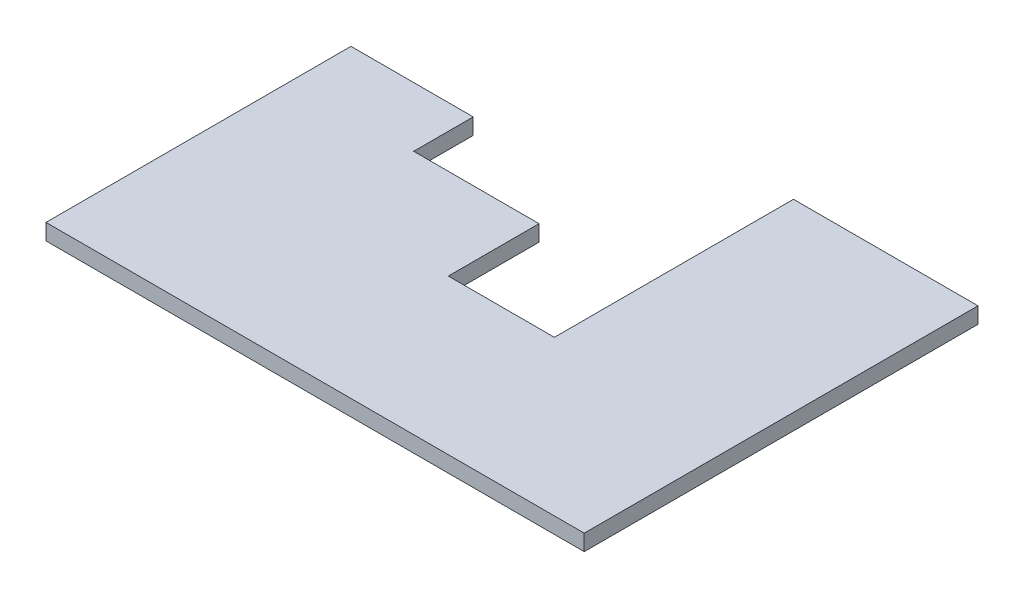
ISO-10303-21;
HEADER;
FILE_DESCRIPTION(('STEP AP214'),'2;1');
FILE_NAME('part.step','',(''),(''),'','','');
FILE_SCHEMA(('AUTOMOTIVE_DESIGN { 1 0 10303 214 1 1 1 1 }'));
ENDSEC;
DATA;
#1=APPLICATION_CONTEXT('core data for automotive mechanical design processes');
#2=APPLICATION_PROTOCOL_DEFINITION('international standard','automotive_design',2000,#1);
#3=PRODUCT_CONTEXT('',#1,'mechanical');
#4=PRODUCT('Part','Part','',(#3));
#5=PRODUCT_RELATED_PRODUCT_CATEGORY('part','',(#4));
#6=PRODUCT_DEFINITION_FORMATION('','',#4);
#7=PRODUCT_DEFINITION_CONTEXT('part definition',#1,'design');
#8=PRODUCT_DEFINITION('design','',#6,#7);
#9=PRODUCT_DEFINITION_SHAPE('','',#8);
#10=(LENGTH_UNIT() NAMED_UNIT(*) SI_UNIT(.MILLI.,.METRE.));
#11=(NAMED_UNIT(*) PLANE_ANGLE_UNIT() SI_UNIT($,.RADIAN.));
#12=(NAMED_UNIT(*) SI_UNIT($,.STERADIAN.) SOLID_ANGLE_UNIT());
#13=UNCERTAINTY_MEASURE_WITH_UNIT(LENGTH_MEASURE(1.E-05),#10,'distance_accuracy_value','');
#14=(GEOMETRIC_REPRESENTATION_CONTEXT(3) GLOBAL_UNCERTAINTY_ASSIGNED_CONTEXT((#13)) GLOBAL_UNIT_ASSIGNED_CONTEXT((#10,
#11,#12)) REPRESENTATION_CONTEXT('',''));
#15=CARTESIAN_POINT('',(0.,0.,0.));
#16=DIRECTION('',(0.,0.,1.));
#17=DIRECTION('',(1.,0.,0.));
#18=AXIS2_PLACEMENT_3D('',#15,#16,#17);
#19=CARTESIAN_POINT('',(97.207622704,2.9,0.));
#20=DIRECTION('',(0.,0.,-1.));
#21=DIRECTION('',(-1.,0.,0.));
#22=AXIS2_PLACEMENT_3D('',#19,#20,#21);
#23=PLANE('',#22);
#24=DIRECTION('',(1.,0.,0.));
#25=VECTOR('',#24,1.);
#26=CARTESIAN_POINT('',(97.207622704,0.,0.));
#27=LINE('',#26,#25);
#28=CARTESIAN_POINT('',(0.,0.,0.));
#29=VERTEX_POINT('',#28);
#30=CARTESIAN_POINT('',(97.207622704,0.,0.));
#31=VERTEX_POINT('',#30);
#32=EDGE_CURVE('E154',#29,#31,#27,.T.);
#33=ORIENTED_EDGE('',*,*,#32,.T.);
#34=DIRECTION('',(0.,-1.,0.));
#35=VECTOR('',#34,1.);
#36=CARTESIAN_POINT('',(97.207622704,2.9,0.));
#37=LINE('',#36,#35);
#38=CARTESIAN_POINT('',(97.207622704,2.9,0.));
#39=VERTEX_POINT('',#38);
#40=EDGE_CURVE('E195',#39,#31,#37,.T.);
#41=ORIENTED_EDGE('',*,*,#40,.F.);
#42=DIRECTION('',(1.,0.,0.));
#43=VECTOR('',#42,1.);
#44=CARTESIAN_POINT('',(97.207622704,2.9,0.));
#45=LINE('',#44,#43);
#46=CARTESIAN_POINT('',(0.,2.9,0.));
#47=VERTEX_POINT('',#46);
#48=EDGE_CURVE('E176',#47,#39,#45,.T.);
#49=ORIENTED_EDGE('',*,*,#48,.F.);
#50=DIRECTION('',(0.,-1.,0.));
#51=VECTOR('',#50,1.);
#52=CARTESIAN_POINT('',(0.,2.9,0.));
#53=LINE('',#52,#51);
#54=EDGE_CURVE('E150',#47,#29,#53,.T.);
#55=ORIENTED_EDGE('',*,*,#54,.T.);
#56=EDGE_LOOP('',(#33,#41,#49,#55));
#57=FACE_BOUND('',#56,.T.);
#58=ADVANCED_FACE('F33',(#57),#23,.F.);
#59=CARTESIAN_POINT('',(97.207622704,2.9,-71.117097796));
#60=DIRECTION('',(-1.,0.,0.));
#61=DIRECTION('',(0.,0.,1.));
#62=AXIS2_PLACEMENT_3D('',#59,#60,#61);
#63=PLANE('',#62);
#64=DIRECTION('',(0.,0.,-1.));
#65=VECTOR('',#64,1.);
#66=CARTESIAN_POINT('',(97.207622704,0.,-71.117097796));
#67=LINE('',#66,#65);
#68=CARTESIAN_POINT('',(97.207622704,0.,-71.117097796));
#69=VERTEX_POINT('',#68);
#70=EDGE_CURVE('E157',#31,#69,#67,.T.);
#71=ORIENTED_EDGE('',*,*,#70,.T.);
#72=DIRECTION('',(0.,-1.,0.));
#73=VECTOR('',#72,1.);
#74=CARTESIAN_POINT('',(97.207622704,2.9,-71.117097796));
#75=LINE('',#74,#73);
#76=CARTESIAN_POINT('',(97.207622704,2.9,-71.117097796));
#77=VERTEX_POINT('',#76);
#78=EDGE_CURVE('E192',#77,#69,#75,.T.);
#79=ORIENTED_EDGE('',*,*,#78,.F.);
#80=DIRECTION('',(0.,0.,-1.));
#81=VECTOR('',#80,1.);
#82=CARTESIAN_POINT('',(97.207622704,2.9,-71.117097796));
#83=LINE('',#82,#81);
#84=EDGE_CURVE('E104',#39,#77,#83,.T.);
#85=ORIENTED_EDGE('',*,*,#84,.F.);
#86=ORIENTED_EDGE('',*,*,#40,.T.);
#87=EDGE_LOOP('',(#71,#79,#85,#86));
#88=FACE_BOUND('',#87,.T.);
#89=ADVANCED_FACE('F255',(#88),#63,.F.);
#90=CARTESIAN_POINT('',(63.88136576,2.9,-71.117097796));
#91=DIRECTION('',(0.,0.,1.));
#92=DIRECTION('',(1.,0.,0.));
#93=AXIS2_PLACEMENT_3D('',#90,#91,#92);
#94=PLANE('',#93);
#95=DIRECTION('',(-1.,0.,0.));
#96=VECTOR('',#95,1.);
#97=CARTESIAN_POINT('',(63.88136576,0.,-71.117097796));
#98=LINE('',#97,#96);
#99=CARTESIAN_POINT('',(63.88136576,0.,-71.117097796));
#100=VERTEX_POINT('',#99);
#101=EDGE_CURVE('E160',#69,#100,#98,.T.);
#102=ORIENTED_EDGE('',*,*,#101,.T.);
#103=DIRECTION('',(0.,-1.,0.));
#104=VECTOR('',#103,1.);
#105=CARTESIAN_POINT('',(63.88136576,2.9,-71.117097796));
#106=LINE('',#105,#104);
#107=CARTESIAN_POINT('',(63.88136576,2.9,-71.117097796));
#108=VERTEX_POINT('',#107);
#109=EDGE_CURVE('E189',#108,#100,#106,.T.);
#110=ORIENTED_EDGE('',*,*,#109,.F.);
#111=DIRECTION('',(-1.,0.,0.));
#112=VECTOR('',#111,1.);
#113=CARTESIAN_POINT('',(63.88136576,2.9,-71.117097796));
#114=LINE('',#113,#112);
#115=EDGE_CURVE('E228',#77,#108,#114,.T.);
#116=ORIENTED_EDGE('',*,*,#115,.F.);
#117=ORIENTED_EDGE('',*,*,#78,.T.);
#118=EDGE_LOOP('',(#102,#110,#116,#117));
#119=FACE_BOUND('',#118,.T.);
#120=ADVANCED_FACE('F258',(#119),#94,.F.);
#121=CARTESIAN_POINT('',(63.88136576,2.9,-27.937097796));
#122=DIRECTION('',(1.,0.,0.));
#123=DIRECTION('',(0.,0.,-1.));
#124=AXIS2_PLACEMENT_3D('',#121,#122,#123);
#125=PLANE('',#124);
#126=DIRECTION('',(0.,0.,1.));
#127=VECTOR('',#126,1.);
#128=CARTESIAN_POINT('',(63.88136576,0.,-27.937097796));
#129=LINE('',#128,#127);
#130=CARTESIAN_POINT('',(63.88136576,0.,-27.937097796));
#131=VERTEX_POINT('',#130);
#132=EDGE_CURVE('E162',#100,#131,#129,.T.);
#133=ORIENTED_EDGE('',*,*,#132,.T.);
#134=DIRECTION('',(0.,-1.,0.));
#135=VECTOR('',#134,1.);
#136=CARTESIAN_POINT('',(63.88136576,2.9,-27.937097796));
#137=LINE('',#136,#135);
#138=CARTESIAN_POINT('',(63.88136576,2.9,-27.937097796));
#139=VERTEX_POINT('',#138);
#140=EDGE_CURVE('E186',#139,#131,#137,.T.);
#141=ORIENTED_EDGE('',*,*,#140,.F.);
#142=DIRECTION('',(0.,0.,1.));
#143=VECTOR('',#142,1.);
#144=CARTESIAN_POINT('',(63.88136576,2.9,-27.937097796));
#145=LINE('',#144,#143);
#146=EDGE_CURVE('E230',#108,#139,#145,.T.);
#147=ORIENTED_EDGE('',*,*,#146,.F.);
#148=ORIENTED_EDGE('',*,*,#109,.T.);
#149=EDGE_LOOP('',(#133,#141,#147,#148));
#150=FACE_BOUND('',#149,.T.);
#151=ADVANCED_FACE('F263',(#150),#125,.F.);
#152=CARTESIAN_POINT('',(44.723008852,2.9,-27.937097796));
#153=DIRECTION('',(0.,0.,1.));
#154=DIRECTION('',(1.,0.,0.));
#155=AXIS2_PLACEMENT_3D('',#152,#153,#154);
#156=PLANE('',#155);
#157=DIRECTION('',(1.,0.,0.));
#158=VECTOR('',#157,1.);
#159=CARTESIAN_POINT('',(46.682187306,1.45,-27.937097796));
#160=LINE('',#159,#158);
#161=CARTESIAN_POINT('',(46.682187306,1.45,-27.937097796));
#162=VERTEX_POINT('',#161);
#163=CARTESIAN_POINT('',(61.922187306,1.45,-27.937097796));
#164=VERTEX_POINT('',#163);
#165=EDGE_CURVE('E212',#162,#164,#160,.T.);
#166=ORIENTED_EDGE('',*,*,#165,.F.);
#167=DIRECTION('',(0.,1.,0.));
#168=VECTOR('',#167,1.);
#169=CARTESIAN_POINT('',(46.682187306,0.,-27.937097796));
#170=LINE('',#169,#168);
#171=CARTESIAN_POINT('',(46.682187306,0.,-27.937097796));
#172=VERTEX_POINT('',#171);
#173=EDGE_CURVE('E217',#172,#162,#170,.T.);
#174=ORIENTED_EDGE('',*,*,#173,.F.);
#175=DIRECTION('',(-1.,0.,0.));
#176=VECTOR('',#175,1.);
#177=CARTESIAN_POINT('',(44.723008852,0.,-27.937097796));
#178=LINE('',#177,#176);
#179=CARTESIAN_POINT('',(44.723008852,0.,-27.937097796));
#180=VERTEX_POINT('',#179);
#181=EDGE_CURVE('E164',#172,#180,#178,.T.);
#182=ORIENTED_EDGE('',*,*,#181,.T.);
#183=DIRECTION('',(0.,-1.,0.));
#184=VECTOR('',#183,1.);
#185=CARTESIAN_POINT('',(44.723008852,2.9,-27.937097796));
#186=LINE('',#185,#184);
#187=CARTESIAN_POINT('',(44.723008852,2.9,-27.937097796));
#188=VERTEX_POINT('',#187);
#189=EDGE_CURVE('E183',#188,#180,#186,.T.);
#190=ORIENTED_EDGE('',*,*,#189,.F.);
#191=DIRECTION('',(-1.,0.,0.));
#192=VECTOR('',#191,1.);
#193=CARTESIAN_POINT('',(44.723008852,2.9,-27.937097796));
#194=LINE('',#193,#192);
#195=EDGE_CURVE('E232',#139,#188,#194,.T.);
#196=ORIENTED_EDGE('',*,*,#195,.F.);
#197=ORIENTED_EDGE('',*,*,#140,.T.);
#198=CARTESIAN_POINT('',(61.922187306,0.,-27.937097796));
#199=VERTEX_POINT('',#198);
#200=EDGE_CURVE('E165',#131,#199,#178,.T.);
#201=ORIENTED_EDGE('',*,*,#200,.T.);
#202=DIRECTION('',(0.,-1.,0.));
#203=VECTOR('',#202,1.);
#204=CARTESIAN_POINT('',(61.922187306,0.,-27.937097796));
#205=LINE('',#204,#203);
#206=EDGE_CURVE('E202',#164,#199,#205,.T.);
#207=ORIENTED_EDGE('',*,*,#206,.F.);
#208=EDGE_LOOP('',(#166,#174,#182,#190,#196,#197,#201,#207));
#209=FACE_BOUND('',#208,.T.);
#210=ADVANCED_FACE('F210',(#209),#156,.F.);
#211=CARTESIAN_POINT('',(44.723008852,2.9,-44.32387376));
#212=DIRECTION('',(-1.,0.,0.));
#213=DIRECTION('',(0.,0.,1.));
#214=AXIS2_PLACEMENT_3D('',#211,#212,#213);
#215=PLANE('',#214);
#216=DIRECTION('',(0.,0.,-1.));
#217=VECTOR('',#216,1.);
#218=CARTESIAN_POINT('',(44.723008852,0.,-44.32387376));
#219=LINE('',#218,#217);
#220=CARTESIAN_POINT('',(44.723008852,0.,-44.32387376));
#221=VERTEX_POINT('',#220);
#222=EDGE_CURVE('E168',#180,#221,#219,.T.);
#223=ORIENTED_EDGE('',*,*,#222,.T.);
#224=DIRECTION('',(0.,-1.,0.));
#225=VECTOR('',#224,1.);
#226=CARTESIAN_POINT('',(44.723008852,2.9,-44.32387376));
#227=LINE('',#226,#225);
#228=CARTESIAN_POINT('',(44.723008852,2.9,-44.32387376));
#229=VERTEX_POINT('',#228);
#230=EDGE_CURVE('E180',#229,#221,#227,.T.);
#231=ORIENTED_EDGE('',*,*,#230,.F.);
#232=DIRECTION('',(0.,0.,-1.));
#233=VECTOR('',#232,1.);
#234=CARTESIAN_POINT('',(44.723008852,2.9,-44.32387376));
#235=LINE('',#234,#233);
#236=EDGE_CURVE('E234',#188,#229,#235,.T.);
#237=ORIENTED_EDGE('',*,*,#236,.F.);
#238=ORIENTED_EDGE('',*,*,#189,.T.);
#239=EDGE_LOOP('',(#223,#231,#237,#238));
#240=FACE_BOUND('',#239,.T.);
#241=ADVANCED_FACE('F240',(#240),#215,.F.);
#242=CARTESIAN_POINT('',(22.080000036,2.9,-44.32387376));
#243=DIRECTION('',(0.,0.,1.));
#244=DIRECTION('',(1.,0.,0.));
#245=AXIS2_PLACEMENT_3D('',#242,#243,#244);
#246=PLANE('',#245);
#247=DIRECTION('',(-1.,0.,0.));
#248=VECTOR('',#247,1.);
#249=CARTESIAN_POINT('',(22.080000036,0.,-44.32387376));
#250=LINE('',#249,#248);
#251=CARTESIAN_POINT('',(22.080000036,0.,-44.32387376));
#252=VERTEX_POINT('',#251);
#253=EDGE_CURVE('E170',#221,#252,#250,.T.);
#254=ORIENTED_EDGE('',*,*,#253,.T.);
#255=DIRECTION('',(0.,-1.,0.));
#256=VECTOR('',#255,1.);
#257=CARTESIAN_POINT('',(22.080000036,2.9,-44.32387376));
#258=LINE('',#257,#256);
#259=CARTESIAN_POINT('',(22.080000036,2.9,-44.32387376));
#260=VERTEX_POINT('',#259);
#261=EDGE_CURVE('E145',#260,#252,#258,.T.);
#262=ORIENTED_EDGE('',*,*,#261,.F.);
#263=DIRECTION('',(-1.,0.,0.));
#264=VECTOR('',#263,1.);
#265=CARTESIAN_POINT('',(22.080000036,2.9,-44.32387376));
#266=LINE('',#265,#264);
#267=EDGE_CURVE('E133',#229,#260,#266,.T.);
#268=ORIENTED_EDGE('',*,*,#267,.F.);
#269=ORIENTED_EDGE('',*,*,#230,.T.);
#270=EDGE_LOOP('',(#254,#262,#268,#269));
#271=FACE_BOUND('',#270,.T.);
#272=ADVANCED_FACE('F244',(#271),#246,.F.);
#273=CARTESIAN_POINT('',(22.080000036,2.9,-55.080000076));
#274=DIRECTION('',(-1.,0.,0.));
#275=DIRECTION('',(0.,0.,1.));
#276=AXIS2_PLACEMENT_3D('',#273,#274,#275);
#277=PLANE('',#276);
#278=DIRECTION('',(0.,0.,-1.));
#279=VECTOR('',#278,1.);
#280=CARTESIAN_POINT('',(22.080000036,0.,-55.080000076));
#281=LINE('',#280,#279);
#282=CARTESIAN_POINT('',(22.080000036,0.,-55.080000076));
#283=VERTEX_POINT('',#282);
#284=EDGE_CURVE('E142',#252,#283,#281,.T.);
#285=ORIENTED_EDGE('',*,*,#284,.T.);
#286=DIRECTION('',(0.,-1.,0.));
#287=VECTOR('',#286,1.);
#288=CARTESIAN_POINT('',(22.080000036,2.9,-55.080000076));
#289=LINE('',#288,#287);
#290=CARTESIAN_POINT('',(22.080000036,2.9,-55.080000076));
#291=VERTEX_POINT('',#290);
#292=EDGE_CURVE('E139',#291,#283,#289,.T.);
#293=ORIENTED_EDGE('',*,*,#292,.F.);
#294=DIRECTION('',(0.,0.,-1.));
#295=VECTOR('',#294,1.);
#296=CARTESIAN_POINT('',(22.080000036,2.9,-55.080000076));
#297=LINE('',#296,#295);
#298=EDGE_CURVE('E126',#260,#291,#297,.T.);
#299=ORIENTED_EDGE('',*,*,#298,.F.);
#300=ORIENTED_EDGE('',*,*,#261,.T.);
#301=EDGE_LOOP('',(#285,#293,#299,#300));
#302=FACE_BOUND('',#301,.T.);
#303=ADVANCED_FACE('F140',(#302),#277,.F.);
#304=CARTESIAN_POINT('',(0.,2.9,-55.080000076));
#305=DIRECTION('',(0.,0.,1.));
#306=DIRECTION('',(1.,0.,0.));
#307=AXIS2_PLACEMENT_3D('',#304,#305,#306);
#308=PLANE('',#307);
#309=DIRECTION('',(-1.,0.,0.));
#310=VECTOR('',#309,1.);
#311=CARTESIAN_POINT('',(0.,0.,-55.080000076));
#312=LINE('',#311,#310);
#313=CARTESIAN_POINT('',(0.,0.,-55.080000076));
#314=VERTEX_POINT('',#313);
#315=EDGE_CURVE('E173',#283,#314,#312,.T.);
#316=ORIENTED_EDGE('',*,*,#315,.T.);
#317=DIRECTION('',(0.,-1.,0.));
#318=VECTOR('',#317,1.);
#319=CARTESIAN_POINT('',(0.,2.9,-55.080000076));
#320=LINE('',#319,#318);
#321=CARTESIAN_POINT('',(0.,2.9,-55.080000076));
#322=VERTEX_POINT('',#321);
#323=EDGE_CURVE('E146',#322,#314,#320,.T.);
#324=ORIENTED_EDGE('',*,*,#323,.F.);
#325=DIRECTION('',(-1.,0.,0.));
#326=VECTOR('',#325,1.);
#327=CARTESIAN_POINT('',(0.,2.9,-55.080000076));
#328=LINE('',#327,#326);
#329=EDGE_CURVE('E130',#291,#322,#328,.T.);
#330=ORIENTED_EDGE('',*,*,#329,.F.);
#331=ORIENTED_EDGE('',*,*,#292,.T.);
#332=EDGE_LOOP('',(#316,#324,#330,#331));
#333=FACE_BOUND('',#332,.T.);
#334=ADVANCED_FACE('F148',(#333),#308,.F.);
#335=CARTESIAN_POINT('',(0.,2.9,0.));
#336=DIRECTION('',(1.,0.,0.));
#337=DIRECTION('',(0.,0.,-1.));
#338=AXIS2_PLACEMENT_3D('',#335,#336,#337);
#339=PLANE('',#338);
#340=DIRECTION('',(0.,0.,1.));
#341=VECTOR('',#340,1.);
#342=CARTESIAN_POINT('',(0.,0.,0.));
#343=LINE('',#342,#341);
#344=EDGE_CURVE('E95',#314,#29,#343,.T.);
#345=ORIENTED_EDGE('',*,*,#344,.T.);
#346=ORIENTED_EDGE('',*,*,#54,.F.);
#347=DIRECTION('',(0.,0.,1.));
#348=VECTOR('',#347,1.);
#349=CARTESIAN_POINT('',(0.,2.9,0.));
#350=LINE('',#349,#348);
#351=EDGE_CURVE('E56',#322,#47,#350,.T.);
#352=ORIENTED_EDGE('',*,*,#351,.F.);
#353=ORIENTED_EDGE('',*,*,#323,.T.);
#354=EDGE_LOOP('',(#345,#346,#352,#353));
#355=FACE_BOUND('',#354,.T.);
#356=ADVANCED_FACE('F249',(#355),#339,.F.);
#357=CARTESIAN_POINT('',(0.,2.9,0.));
#358=DIRECTION('',(0.,-1.,0.));
#359=DIRECTION('',(0.,0.,-1.));
#360=AXIS2_PLACEMENT_3D('',#357,#358,#359);
#361=PLANE('',#360);
#362=ORIENTED_EDGE('',*,*,#48,.T.);
#363=ORIENTED_EDGE('',*,*,#84,.T.);
#364=ORIENTED_EDGE('',*,*,#115,.T.);
#365=ORIENTED_EDGE('',*,*,#146,.T.);
#366=ORIENTED_EDGE('',*,*,#195,.T.);
#367=ORIENTED_EDGE('',*,*,#236,.T.);
#368=ORIENTED_EDGE('',*,*,#267,.T.);
#369=ORIENTED_EDGE('',*,*,#298,.T.);
#370=ORIENTED_EDGE('',*,*,#329,.T.);
#371=ORIENTED_EDGE('',*,*,#351,.T.);
#372=EDGE_LOOP('',(#362,#363,#364,#365,#366,#367,#368,#369,#370,#371));
#373=FACE_BOUND('',#372,.T.);
#374=ADVANCED_FACE('F128',(#373),#361,.F.);
#375=CARTESIAN_POINT('',(0.,0.,0.));
#376=DIRECTION('',(0.,-1.,0.));
#377=DIRECTION('',(0.,0.,-1.));
#378=AXIS2_PLACEMENT_3D('',#375,#376,#377);
#379=PLANE('',#378);
#380=DIRECTION('',(0.,0.,-1.));
#381=VECTOR('',#380,1.);
#382=CARTESIAN_POINT('',(46.682187306,0.,-26.487097796));
#383=LINE('',#382,#381);
#384=CARTESIAN_POINT('',(46.682187306,0.,-26.487097796));
#385=VERTEX_POINT('',#384);
#386=EDGE_CURVE('E158',#385,#172,#383,.T.);
#387=ORIENTED_EDGE('',*,*,#386,.F.);
#388=DIRECTION('',(-1.,0.,0.));
#389=VECTOR('',#388,1.);
#390=CARTESIAN_POINT('',(46.682187306,0.,-26.487097796));
#391=LINE('',#390,#389);
#392=CARTESIAN_POINT('',(61.922187306,0.,-26.487097796));
#393=VERTEX_POINT('',#392);
#394=EDGE_CURVE('E215',#393,#385,#391,.T.);
#395=ORIENTED_EDGE('',*,*,#394,.F.);
#396=DIRECTION('',(0.,0.,-1.));
#397=VECTOR('',#396,1.);
#398=CARTESIAN_POINT('',(61.922187306,0.,-26.487097796));
#399=LINE('',#398,#397);
#400=EDGE_CURVE('E204',#393,#199,#399,.T.);
#401=ORIENTED_EDGE('',*,*,#400,.T.);
#402=ORIENTED_EDGE('',*,*,#200,.F.);
#403=ORIENTED_EDGE('',*,*,#132,.F.);
#404=ORIENTED_EDGE('',*,*,#101,.F.);
#405=ORIENTED_EDGE('',*,*,#70,.F.);
#406=ORIENTED_EDGE('',*,*,#32,.F.);
#407=ORIENTED_EDGE('',*,*,#344,.F.);
#408=ORIENTED_EDGE('',*,*,#315,.F.);
#409=ORIENTED_EDGE('',*,*,#284,.F.);
#410=ORIENTED_EDGE('',*,*,#253,.F.);
#411=ORIENTED_EDGE('',*,*,#222,.F.);
#412=ORIENTED_EDGE('',*,*,#181,.F.);
#413=EDGE_LOOP('',(#387,#395,#401,#402,#403,#404,#405,#406,#407,#408,#409,#410,#411,#412));
#414=FACE_BOUND('',#413,.T.);
#415=ADVANCED_FACE('F247',(#414),#379,.T.);
#416=CARTESIAN_POINT('',(46.682187306,0.,-26.487097796));
#417=DIRECTION('',(-1.,0.,0.));
#418=DIRECTION('',(0.,0.,1.));
#419=AXIS2_PLACEMENT_3D('',#416,#417,#418);
#420=PLANE('',#419);
#421=ORIENTED_EDGE('',*,*,#173,.T.);
#422=CARTESIAN_POINT('',(46.682187306,-0.918220922456867,-28.8553187184569));
#423=DIRECTION('',(-1.,0.,0.));
#424=DIRECTION('',(0.,0.,1.));
#425=AXIS2_PLACEMENT_3D('',#422,#423,#424);
#426=CIRCLE('',#425,2.54);
#427=EDGE_CURVE('E11',#162,#385,#426,.F.);
#428=ORIENTED_EDGE('',*,*,#427,.T.);
#429=ORIENTED_EDGE('',*,*,#386,.T.);
#430=EDGE_LOOP('',(#421,#428,#429));
#431=FACE_BOUND('',#430,.T.);
#432=ADVANCED_FACE('F268',(#431),#420,.F.);
#433=CARTESIAN_POINT('',(61.922187306,0.,-26.487097796));
#434=DIRECTION('',(1.,0.,0.));
#435=DIRECTION('',(0.,0.,-1.));
#436=AXIS2_PLACEMENT_3D('',#433,#434,#435);
#437=PLANE('',#436);
#438=ORIENTED_EDGE('',*,*,#400,.F.);
#439=CARTESIAN_POINT('',(61.922187306,-0.918220922456867,-28.8553187184569));
#440=DIRECTION('',(1.,0.,0.));
#441=DIRECTION('',(0.,0.,-1.));
#442=AXIS2_PLACEMENT_3D('',#439,#440,#441);
#443=CIRCLE('',#442,2.54);
#444=EDGE_CURVE('E41',#393,#164,#443,.F.);
#445=ORIENTED_EDGE('',*,*,#444,.T.);
#446=ORIENTED_EDGE('',*,*,#206,.T.);
#447=EDGE_LOOP('',(#438,#445,#446));
#448=FACE_BOUND('',#447,.T.);
#449=ADVANCED_FACE('F200',(#448),#437,.F.);
#450=CARTESIAN_POINT('',(46.682187306,-0.918220922456867,-28.8553187184569));
#451=DIRECTION('',(-1.,0.,0.));
#452=DIRECTION('',(0.,0.,1.));
#453=AXIS2_PLACEMENT_3D('',#450,#451,#452);
#454=CYLINDRICAL_SURFACE('',#453,2.54);
#455=ORIENTED_EDGE('',*,*,#427,.F.);
#456=ORIENTED_EDGE('',*,*,#165,.T.);
#457=ORIENTED_EDGE('',*,*,#444,.F.);
#458=ORIENTED_EDGE('',*,*,#394,.T.);
#459=EDGE_LOOP('',(#455,#456,#457,#458));
#460=FACE_BOUND('',#459,.T.);
#461=ADVANCED_FACE('F35',(#460),#454,.F.);
#462=CLOSED_SHELL('',(#58,#89,#120,#151,#210,#241,#272,#303,#334,#356,#374,#415,#432,#449,#461));
#463=MANIFOLD_SOLID_BREP('B2',#462);
#464=ADVANCED_BREP_SHAPE_REPRESENTATION('',(#18,#463),#14);
#465=SHAPE_DEFINITION_REPRESENTATION(#9,#464);
ENDSEC;
END-ISO-10303-21;
